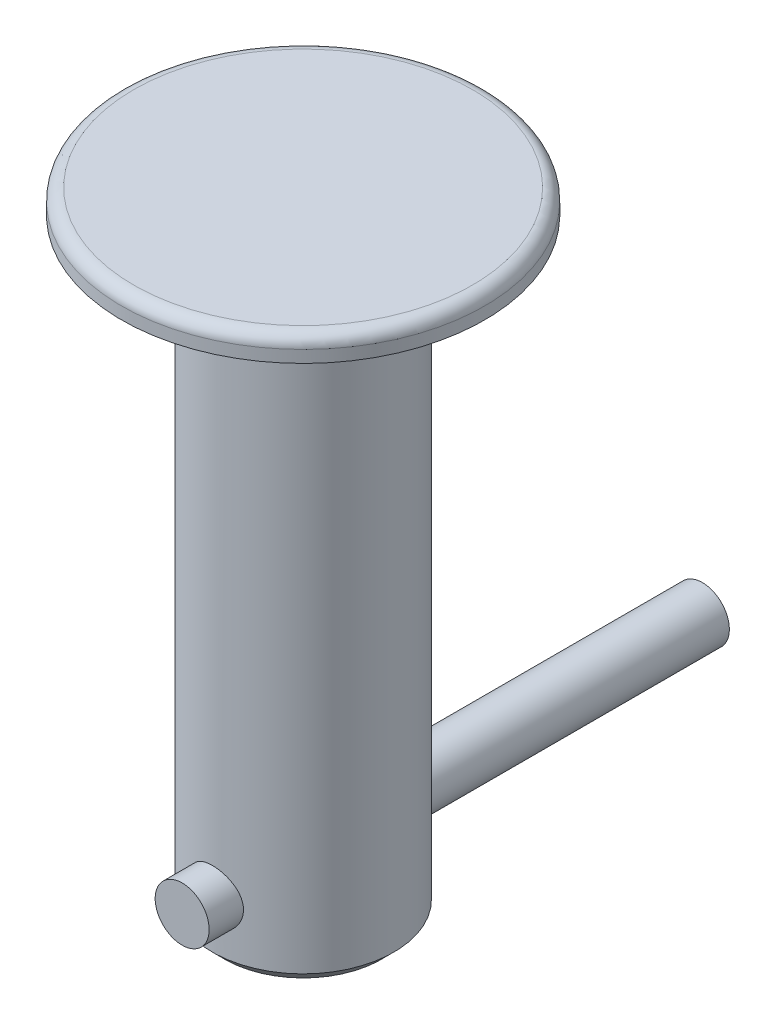
ISO-10303-21;
HEADER;
FILE_DESCRIPTION(('STEP AP214'),'2;1');
FILE_NAME('part.step','',(''),(''),'','','');
FILE_SCHEMA(('AUTOMOTIVE_DESIGN { 1 0 10303 214 1 1 1 1 }'));
ENDSEC;
DATA;
#1=APPLICATION_CONTEXT('core data for automotive mechanical design processes');
#2=APPLICATION_PROTOCOL_DEFINITION('international standard','automotive_design',2000,#1);
#3=PRODUCT_CONTEXT('',#1,'mechanical');
#4=PRODUCT('Part','Part','',(#3));
#5=PRODUCT_RELATED_PRODUCT_CATEGORY('part','',(#4));
#6=PRODUCT_DEFINITION_FORMATION('','',#4);
#7=PRODUCT_DEFINITION_CONTEXT('part definition',#1,'design');
#8=PRODUCT_DEFINITION('design','',#6,#7);
#9=PRODUCT_DEFINITION_SHAPE('','',#8);
#10=(LENGTH_UNIT() NAMED_UNIT(*) SI_UNIT(.MILLI.,.METRE.));
#11=(NAMED_UNIT(*) PLANE_ANGLE_UNIT() SI_UNIT($,.RADIAN.));
#12=(NAMED_UNIT(*) SI_UNIT($,.STERADIAN.) SOLID_ANGLE_UNIT());
#13=UNCERTAINTY_MEASURE_WITH_UNIT(LENGTH_MEASURE(1.E-05),#10,'distance_accuracy_value','');
#14=(GEOMETRIC_REPRESENTATION_CONTEXT(3) GLOBAL_UNCERTAINTY_ASSIGNED_CONTEXT((#13)) GLOBAL_UNIT_ASSIGNED_CONTEXT((#10,
#11,#12)) REPRESENTATION_CONTEXT('',''));
#15=CARTESIAN_POINT('',(0.,0.,0.));
#16=DIRECTION('',(0.,0.,1.));
#17=DIRECTION('',(1.,0.,0.));
#18=AXIS2_PLACEMENT_3D('',#15,#16,#17);
#19=CARTESIAN_POINT('',(0.,2.,0.));
#20=DIRECTION('',(0.,1.,0.));
#21=DIRECTION('',(-1.,0.,0.));
#22=AXIS2_PLACEMENT_3D('',#19,#20,#21);
#23=PLANE('',#22);
#24=CARTESIAN_POINT('',(0.,2.,0.));
#25=DIRECTION('',(0.,1.,0.));
#26=DIRECTION('',(-1.,0.,0.));
#27=AXIS2_PLACEMENT_3D('',#24,#25,#26);
#28=CIRCLE('',#27,14.);
#29=CARTESIAN_POINT('',(-14.,2.,0.));
#30=VERTEX_POINT('',#29);
#31=EDGE_CURVE('E54',#30,#30,#28,.T.);
#32=ORIENTED_EDGE('',*,*,#31,.T.);
#33=EDGE_LOOP('',(#32));
#34=FACE_BOUND('',#33,.T.);
#35=ADVANCED_FACE('F35',(#34),#23,.T.);
#36=CARTESIAN_POINT('',(0.,0.,0.));
#37=DIRECTION('',(0.,1.,0.));
#38=DIRECTION('',(-1.,0.,0.));
#39=AXIS2_PLACEMENT_3D('',#36,#37,#38);
#40=CYLINDRICAL_SURFACE('',#39,15.);
#41=CARTESIAN_POINT('',(0.,1.,0.));
#42=DIRECTION('',(0.,1.,0.));
#43=DIRECTION('',(-1.,0.,0.));
#44=AXIS2_PLACEMENT_3D('',#41,#42,#43);
#45=CIRCLE('',#44,15.);
#46=CARTESIAN_POINT('',(-15.,0.999999999999999,0.));
#47=VERTEX_POINT('',#46);
#48=EDGE_CURVE('E50',#47,#47,#45,.F.);
#49=ORIENTED_EDGE('',*,*,#48,.T.);
#50=EDGE_LOOP('',(#49));
#51=FACE_BOUND('',#50,.T.);
#52=CARTESIAN_POINT('',(0.,0.,0.));
#53=DIRECTION('',(0.,1.,0.));
#54=DIRECTION('',(-1.,0.,0.));
#55=AXIS2_PLACEMENT_3D('',#52,#53,#54);
#56=CIRCLE('',#55,15.);
#57=CARTESIAN_POINT('',(-15.,0.,0.));
#58=VERTEX_POINT('',#57);
#59=EDGE_CURVE('E101',#58,#58,#56,.T.);
#60=ORIENTED_EDGE('',*,*,#59,.T.);
#61=EDGE_LOOP('',(#60));
#62=FACE_BOUND('',#61,.T.);
#63=ADVANCED_FACE('F85',(#51,#62),#40,.T.);
#64=CARTESIAN_POINT('',(0.,0.,0.));
#65=DIRECTION('',(0.,1.,0.));
#66=DIRECTION('',(-1.,0.,0.));
#67=AXIS2_PLACEMENT_3D('',#64,#65,#66);
#68=PLANE('',#67);
#69=ORIENTED_EDGE('',*,*,#59,.F.);
#70=EDGE_LOOP('',(#69));
#71=FACE_BOUND('',#70,.T.);
#72=CARTESIAN_POINT('',(0.,0.,0.));
#73=DIRECTION('',(0.,1.,0.));
#74=DIRECTION('',(-1.,0.,0.));
#75=AXIS2_PLACEMENT_3D('',#72,#73,#74);
#76=CIRCLE('',#75,7.5);
#77=CARTESIAN_POINT('',(-7.5,0.,0.));
#78=VERTEX_POINT('',#77);
#79=EDGE_CURVE('E104',#78,#78,#76,.T.);
#80=ORIENTED_EDGE('',*,*,#79,.T.);
#81=EDGE_LOOP('',(#80));
#82=FACE_BOUND('',#81,.T.);
#83=ADVANCED_FACE('F81',(#71,#82),#68,.F.);
#84=CARTESIAN_POINT('',(0.,0.,0.));
#85=DIRECTION('',(0.,1.,0.));
#86=DIRECTION('',(-1.,0.,0.));
#87=AXIS2_PLACEMENT_3D('',#84,#85,#86);
#88=CYLINDRICAL_SURFACE('',#87,7.5);
#89=CARTESIAN_POINT('',(2.23039128314299,-45.0197459356697,-7.16068116341453));
#90=CARTESIAN_POINT('',(2.23038962713588,-45.1420172086892,-7.16068252015822));
#91=CARTESIAN_POINT('',(2.22030261492113,-45.2643048993603,-7.16384717289941));
#92=CARTESIAN_POINT('',(2.18032272965578,-45.5053086655589,-7.17611435312003));
#93=CARTESIAN_POINT('',(2.15042297462845,-45.6240234850615,-7.18521894382611));
#94=CARTESIAN_POINT('',(2.07191973773352,-45.8543579413405,-7.20824561723514));
#95=CARTESIAN_POINT('',(2.0233469615472,-45.9659888774978,-7.22215978735746));
#96=CARTESIAN_POINT('',(1.90897703327328,-46.1795440916206,-7.25322718496514));
#97=CARTESIAN_POINT('',(1.84317740023542,-46.2814669685802,-7.27038087889588));
#98=CARTESIAN_POINT('',(1.69403099333355,-46.4758824045404,-7.30659276129618));
#99=CARTESIAN_POINT('',(1.61024214744951,-46.5680284479204,-7.32569098601709));
#100=CARTESIAN_POINT('',(1.42844342237811,-46.7371901590806,-7.36329774723439));
#101=CARTESIAN_POINT('',(1.33043174904954,-46.8142039151063,-7.38180620897525));
#102=CARTESIAN_POINT('',(1.12050962660798,-46.9524146784126,-7.41660215811796));
#103=CARTESIAN_POINT('',(1.00835754273942,-47.0132590996787,-7.43283696876858));
#104=CARTESIAN_POINT('',(0.774848744709643,-47.1150903681032,-7.46079171432808));
#105=CARTESIAN_POINT('',(0.653493985816778,-47.1560814198594,-7.47251260509877));
#106=CARTESIAN_POINT('',(0.40864921257445,-47.2158977135471,-7.48983561667407));
#107=CARTESIAN_POINT('',(0.285315390110754,-47.235314264064,-7.49560064437347));
#108=CARTESIAN_POINT('',(0.0370149659236924,-47.2532993462391,-7.50093572729731));
#109=CARTESIAN_POINT('',(-0.0879512932820197,-47.251872183293,-7.50050706186693));
#110=CARTESIAN_POINT('',(-0.331823624311856,-47.2286088642215,-7.49361855744024));
#111=CARTESIAN_POINT('',(-0.450796950869426,-47.2074129186571,-7.48734791735631));
#112=CARTESIAN_POINT('',(-0.683414465096458,-47.146258546536,-7.46970942914605));
#113=CARTESIAN_POINT('',(-0.797058317071128,-47.1062989398286,-7.45834126040988));
#114=CARTESIAN_POINT('',(-1.01732198250068,-47.0083134466728,-7.43152193635796));
#115=CARTESIAN_POINT('',(-1.12384580398572,-46.9500847516064,-7.41602525635621));
#116=CARTESIAN_POINT('',(-1.32581624183355,-46.8173739876691,-7.38259481006543));
#117=CARTESIAN_POINT('',(-1.4212602587352,-46.7428881164187,-7.36466047400559));
#118=CARTESIAN_POINT('',(-1.6021827619474,-46.5764504149946,-7.32747364129597));
#119=CARTESIAN_POINT('',(-1.68714634216678,-46.4839435376971,-7.30819694769795));
#120=CARTESIAN_POINT('',(-1.84049826844691,-46.2858055752003,-7.27109396461215));
#121=CARTESIAN_POINT('',(-1.90888502620071,-46.1801732338511,-7.25326781421668));
#122=CARTESIAN_POINT('',(-2.02766666108713,-45.9574471281368,-7.22097003978414));
#123=CARTESIAN_POINT('',(-2.07788870754404,-45.8402561101646,-7.20653107644645));
#124=CARTESIAN_POINT('',(-2.15773367877396,-45.5985513481028,-7.1830312186394));
#125=CARTESIAN_POINT('',(-2.18736318648433,-45.474039957977,-7.17396860561644));
#126=CARTESIAN_POINT('',(-2.22422577768206,-45.2261225373443,-7.16262384643026));
#127=CARTESIAN_POINT('',(-2.23224037450195,-45.1028434337109,-7.16010522307408));
#128=CARTESIAN_POINT('',(-2.22782567897405,-44.8566990567673,-7.16148026171891));
#129=CARTESIAN_POINT('',(-2.21539918922544,-44.7338337290403,-7.16537304467662));
#130=CARTESIAN_POINT('',(-2.17115052048643,-44.495243378125,-7.17890047397109));
#131=CARTESIAN_POINT('',(-2.13982887390321,-44.3794162650682,-7.18838680560012));
#132=CARTESIAN_POINT('',(-2.0592579146541,-44.1546682701726,-7.21187951682311));
#133=CARTESIAN_POINT('',(-2.01000586686802,-44.045748444956,-7.22588658597759));
#134=CARTESIAN_POINT('',(-1.89348138098505,-43.8347208728094,-7.25730329266191));
#135=CARTESIAN_POINT('',(-1.8257666802352,-43.7328695713429,-7.27479314258952));
#136=CARTESIAN_POINT('',(-1.67476612757772,-43.5416899015162,-7.31103114188238));
#137=CARTESIAN_POINT('',(-1.59147661411199,-43.4523644865862,-7.32977958647099));
#138=CARTESIAN_POINT('',(-1.40802131015667,-43.2853682728577,-7.36726169797105));
#139=CARTESIAN_POINT('',(-1.30734519236205,-43.2082508592847,-7.38596916085803));
#140=CARTESIAN_POINT('',(-1.09403680993874,-43.071993004387,-7.4205619819491));
#141=CARTESIAN_POINT('',(-0.981405146785843,-43.0128516592758,-7.43644748201694));
#142=CARTESIAN_POINT('',(-0.74813541876216,-42.914794938556,-7.46350857381306));
#143=CARTESIAN_POINT('',(-0.627565408159063,-42.8757278709379,-7.47471936480696));
#144=CARTESIAN_POINT('',(-0.38117914440466,-42.8185349457795,-7.49132334668309));
#145=CARTESIAN_POINT('',(-0.255364374097608,-42.8004032102697,-7.49671817047407));
#146=CARTESIAN_POINT('',(-0.0071784204063822,-42.7860363340732,-7.50098477035609));
#147=CARTESIAN_POINT('',(0.115142737443675,-42.7889979775668,-7.5000958359071));
#148=CARTESIAN_POINT('',(0.357469376434651,-42.8148181962398,-7.49245690838212));
#149=CARTESIAN_POINT('',(0.477474984604598,-42.8376756767607,-7.48570723776081));
#150=CARTESIAN_POINT('',(0.710552193768124,-42.9021448114082,-7.46717183623904));
#151=CARTESIAN_POINT('',(0.82368289261493,-42.9435591058825,-7.45543916841102));
#152=CARTESIAN_POINT('',(1.04144979926863,-43.0437899807811,-7.42815179777043));
#153=CARTESIAN_POINT('',(1.14608462156045,-43.1026093924121,-7.41259647321449));
#154=CARTESIAN_POINT('',(1.34748125638725,-43.2381361266656,-7.37868947119974));
#155=CARTESIAN_POINT('',(1.44388997065791,-43.3153498033153,-7.36026498357221));
#156=CARTESIAN_POINT('',(1.62265086631906,-43.4845574647224,-7.3229338268028));
#157=CARTESIAN_POINT('',(1.70499901666604,-43.5765556734537,-7.30402702116413));
#158=CARTESIAN_POINT('',(1.85570842720902,-43.7759385602619,-7.2672244082684));
#159=CARTESIAN_POINT('',(1.92359226084419,-43.8836934399118,-7.24937410741844));
#160=CARTESIAN_POINT('',(2.04020017249895,-44.1095993539522,-7.21742752832217));
#161=CARTESIAN_POINT('',(2.08893374586996,-44.2277452004922,-7.20332939074742));
#162=CARTESIAN_POINT('',(2.16129924938426,-44.4573815555663,-7.18192485509835));
#163=CARTESIAN_POINT('',(2.18713828975532,-44.5681255631295,-7.17403282621482));
#164=CARTESIAN_POINT('',(2.22168343190508,-44.7924906699114,-7.16341084531984));
#165=CARTESIAN_POINT('',(2.23039282217915,-44.9061112126591,-7.16067990250354));
#166=CARTESIAN_POINT('',(2.23039128314299,-45.0197459356697,-7.16068116341453));
#167=B_SPLINE_CURVE_WITH_KNOTS('',3,(#89,#90,#91,#92,#93,#94,#95,#96,#97,#98,#99,#100,#101,#102,
#103,#104,#105,#106,#107,#108,#109,#110,#111,#112,#113,#114,#115,#116,#117,#118,#119,#120,#121,
#122,#123,#124,#125,#126,#127,#128,#129,#130,#131,#132,#133,#134,#135,#136,#137,#138,#139,#140,
#141,#142,#143,#144,#145,#146,#147,#148,#149,#150,#151,#152,#153,#154,#155,#156,#157,#158,#159,
#160,#161,#162,#163,#164,#165,#166),.UNSPECIFIED.,.T.,.F.,(4,2,2,2,2,2,2,2,2,2,2,2,2,2,2,2,2,2,
2,2,2,2,2,2,2,2,2,2,2,2,2,2,2,2,2,2,2,2,4),(0.,0.366394750832368,0.73291683602049,
1.09883877725747,1.46481344627914,1.84109720628874,2.21742847401154,2.60139468547264,
2.98527954398119,3.35836146009992,3.73136631497042,4.09269591958792,4.45404825327417,
4.81956311569569,5.18516355991581,5.56462272103515,5.94411822564616,6.32713498878459,
6.71002925432467,7.0788812928067,7.44768276361187,7.8071191663269,8.16661042079672,
8.53561208896756,8.90470061683975,9.28744295351398,9.67016604378587,10.0499528942697,
10.4296330868435,10.7949348799777,11.1602165756692,11.5217023054471,11.8832468687269,
12.2562119222395,12.6292837227617,13.0132253164461,13.3969762978707,13.7375563891414,
14.0780710905524),.UNSPECIFIED.);
#168=CARTESIAN_POINT('',(2.23039128314299,-45.0197459356697,-7.16068116341453));
#169=VERTEX_POINT('',#168);
#170=EDGE_CURVE('E10',#169,#169,#167,.T.);
#171=ORIENTED_EDGE('',*,*,#170,.F.);
#172=EDGE_LOOP('',(#171));
#173=FACE_BOUND('',#172,.T.);
#174=CARTESIAN_POINT('',(2.23039128314299,-45.0197459356697,7.16068116341453));
#175=CARTESIAN_POINT('',(2.23038962713588,-44.8974746626502,7.16068252015822));
#176=CARTESIAN_POINT('',(2.22030261492113,-44.7751869719791,7.16384717289941));
#177=CARTESIAN_POINT('',(2.18032272965578,-44.5341832057805,7.17611435312003));
#178=CARTESIAN_POINT('',(2.15042297462845,-44.4154683862779,7.18521894382611));
#179=CARTESIAN_POINT('',(2.07191973773352,-44.1851339299989,7.20824561723514));
#180=CARTESIAN_POINT('',(2.0233469615472,-44.0735029938416,7.22215978735746));
#181=CARTESIAN_POINT('',(1.90897703327328,-43.8599477797189,7.25322718496514));
#182=CARTESIAN_POINT('',(1.84317740023542,-43.7580249027592,7.27038087889588));
#183=CARTESIAN_POINT('',(1.69403099333355,-43.563609466799,7.30659276129618));
#184=CARTESIAN_POINT('',(1.61024214744951,-43.471463423419,7.32569098601709));
#185=CARTESIAN_POINT('',(1.42844342237811,-43.3023017122588,7.36329774723439));
#186=CARTESIAN_POINT('',(1.33043174904954,-43.2252879562331,7.38180620897525));
#187=CARTESIAN_POINT('',(1.12050962660798,-43.0870771929268,7.41660215811796));
#188=CARTESIAN_POINT('',(1.00835754273942,-43.0262327716607,7.43283696876858));
#189=CARTESIAN_POINT('',(0.774848744709643,-42.9244015032363,7.46079171432808));
#190=CARTESIAN_POINT('',(0.653493985816778,-42.88341045148,7.47251260509877));
#191=CARTESIAN_POINT('',(0.40864921257445,-42.8235941577923,7.48983561667407));
#192=CARTESIAN_POINT('',(0.285315390110754,-42.8041776072754,7.49560064437347));
#193=CARTESIAN_POINT('',(0.0370149659236924,-42.7861925251003,7.50093572729731));
#194=CARTESIAN_POINT('',(-0.0879512932820198,-42.7876196880464,7.50050706186693));
#195=CARTESIAN_POINT('',(-0.331823624311856,-42.8108830071179,7.49361855744024));
#196=CARTESIAN_POINT('',(-0.450796950869426,-42.8320789526823,7.48734791735631));
#197=CARTESIAN_POINT('',(-0.683414465096458,-42.8932333248034,7.46970942914605));
#198=CARTESIAN_POINT('',(-0.797058317071128,-42.9331929315108,7.45834126040988));
#199=CARTESIAN_POINT('',(-1.01732198250068,-43.0311784246666,7.43152193635796));
#200=CARTESIAN_POINT('',(-1.12384580398572,-43.089407119733,7.41602525635621));
#201=CARTESIAN_POINT('',(-1.32581624183355,-43.2221178836703,7.38259481006543));
#202=CARTESIAN_POINT('',(-1.4212602587352,-43.2966037549207,7.36466047400559));
#203=CARTESIAN_POINT('',(-1.6021827619474,-43.4630414563448,7.32747364129597));
#204=CARTESIAN_POINT('',(-1.68714634216678,-43.5555483336423,7.30819694769795));
#205=CARTESIAN_POINT('',(-1.84049826844691,-43.7536862961392,7.27109396461215));
#206=CARTESIAN_POINT('',(-1.90888502620071,-43.8593186374883,7.25326781421668));
#207=CARTESIAN_POINT('',(-2.02766666108713,-44.0820447432026,7.22097003978414));
#208=CARTESIAN_POINT('',(-2.07788870754404,-44.1992357611748,7.20653107644645));
#209=CARTESIAN_POINT('',(-2.15773367877396,-44.4409405232366,7.1830312186394));
#210=CARTESIAN_POINT('',(-2.18736318648433,-44.5654519133624,7.17396860561644));
#211=CARTESIAN_POINT('',(-2.22422577768206,-44.8133693339951,7.16262384643026));
#212=CARTESIAN_POINT('',(-2.23224037450195,-44.9366484376285,7.16010522307408));
#213=CARTESIAN_POINT('',(-2.22782567897405,-45.1827928145721,7.16148026171891));
#214=CARTESIAN_POINT('',(-2.21539918922544,-45.3056581422991,7.16537304467662));
#215=CARTESIAN_POINT('',(-2.17115052048643,-45.5442484932144,7.17890047397109));
#216=CARTESIAN_POINT('',(-2.13982887390321,-45.6600756062712,7.18838680560012));
#217=CARTESIAN_POINT('',(-2.0592579146541,-45.8848236011668,7.21187951682311));
#218=CARTESIAN_POINT('',(-2.01000586686802,-45.9937434263834,7.22588658597759));
#219=CARTESIAN_POINT('',(-1.89348138098505,-46.20477099853,7.25730329266191));
#220=CARTESIAN_POINT('',(-1.82576668023521,-46.3066222999965,7.27479314258952));
#221=CARTESIAN_POINT('',(-1.67476612757773,-46.4978019698232,7.31103114188237));
#222=CARTESIAN_POINT('',(-1.591476614112,-46.5871273847532,7.32977958647099));
#223=CARTESIAN_POINT('',(-1.40802131015667,-46.7541235984817,7.36726169797105));
#224=CARTESIAN_POINT('',(-1.30734519236205,-46.8312410120547,7.38596916085803));
#225=CARTESIAN_POINT('',(-1.09403680993874,-46.9674988669524,7.4205619819491));
#226=CARTESIAN_POINT('',(-0.981405146785843,-47.0266402120636,7.43644748201694));
#227=CARTESIAN_POINT('',(-0.74813541876216,-47.1246969327834,7.46350857381306));
#228=CARTESIAN_POINT('',(-0.627565408159064,-47.1637640004015,7.47471936480696));
#229=CARTESIAN_POINT('',(-0.381179144404661,-47.2209569255599,7.49132334668309));
#230=CARTESIAN_POINT('',(-0.255364374097609,-47.2390886610697,7.49671817047407));
#231=CARTESIAN_POINT('',(-0.00717842040638201,-47.2534555372662,7.50098477035609));
#232=CARTESIAN_POINT('',(0.115142737443675,-47.2504938937726,7.5000958359071));
#233=CARTESIAN_POINT('',(0.357469376434651,-47.2246736750996,7.49245690838212));
#234=CARTESIAN_POINT('',(0.477474984604598,-47.2018161945787,7.48570723776081));
#235=CARTESIAN_POINT('',(0.710552193768124,-47.1373470599312,7.46717183623904));
#236=CARTESIAN_POINT('',(0.82368289261493,-47.0959327654569,7.45543916841102));
#237=CARTESIAN_POINT('',(1.04144979926863,-46.9957018905583,7.42815179777043));
#238=CARTESIAN_POINT('',(1.14608462156045,-46.9368824789273,7.41259647321449));
#239=CARTESIAN_POINT('',(1.34748125638725,-46.8013557446738,7.37868947119974));
#240=CARTESIAN_POINT('',(1.44388997065791,-46.7241420680241,7.36026498357221));
#241=CARTESIAN_POINT('',(1.62265086631906,-46.554934406617,7.3229338268028));
#242=CARTESIAN_POINT('',(1.70499901666604,-46.4629361978857,7.30402702116413));
#243=CARTESIAN_POINT('',(1.85570842720902,-46.2635533110775,7.2672244082684));
#244=CARTESIAN_POINT('',(1.92359226084419,-46.1557984314276,7.24937410741844));
#245=CARTESIAN_POINT('',(2.04020017249895,-45.9298925173872,7.21742752832217));
#246=CARTESIAN_POINT('',(2.08893374586996,-45.8117466708472,7.20332939074742));
#247=CARTESIAN_POINT('',(2.16129924938426,-45.5821103157731,7.18192485509835));
#248=CARTESIAN_POINT('',(2.18713828975532,-45.4713663082099,7.17403282621482));
#249=CARTESIAN_POINT('',(2.22168343190508,-45.247001201428,7.16341084531984));
#250=CARTESIAN_POINT('',(2.23039282217915,-45.1333806586803,7.16067990250354));
#251=CARTESIAN_POINT('',(2.23039128314299,-45.0197459356697,7.16068116341453));
#252=B_SPLINE_CURVE_WITH_KNOTS('',3,(#174,#175,#176,#177,#178,#179,#180,#181,#182,#183,#184,
#185,#186,#187,#188,#189,#190,#191,#192,#193,#194,#195,#196,#197,#198,#199,#200,#201,#202,#203,
#204,#205,#206,#207,#208,#209,#210,#211,#212,#213,#214,#215,#216,#217,#218,#219,#220,#221,#222,
#223,#224,#225,#226,#227,#228,#229,#230,#231,#232,#233,#234,#235,#236,#237,#238,#239,#240,#241,
#242,#243,#244,#245,#246,#247,#248,#249,#250,#251),.UNSPECIFIED.,.T.,.F.,(4,2,2,2,2,2,2,2,2,2,2,
2,2,2,2,2,2,2,2,2,2,2,2,2,2,2,2,2,2,2,2,2,2,2,2,2,2,2,4),(0.,0.366394750832368,0.73291683602049,
1.09883877725747,1.46481344627914,1.84109720628874,2.21742847401154,2.60139468547264,
2.98527954398119,3.35836146009992,3.73136631497042,4.09269591958792,4.45404825327417,
4.81956311569569,5.18516355991581,5.56462272103515,5.94411822564616,6.32713498878459,
6.71002925432467,7.07888129280671,7.44768276361187,7.8071191663269,8.16661042079672,
8.53561208896755,8.90470061683975,9.28744295351398,9.67016604378587,10.0499528942697,
10.4296330868435,10.7949348799777,11.1602165756692,11.5217023054471,11.8832468687269,
12.2562119222395,12.6292837227617,13.0132253164461,13.3969762978707,13.7375563891414,
14.0780710905524),.UNSPECIFIED.);
#253=CARTESIAN_POINT('',(2.23039128314299,-45.0197459356697,7.16068116341453));
#254=VERTEX_POINT('',#253);
#255=EDGE_CURVE('E46',#254,#254,#252,.T.);
#256=ORIENTED_EDGE('',*,*,#255,.F.);
#257=EDGE_LOOP('',(#256));
#258=FACE_BOUND('',#257,.T.);
#259=CARTESIAN_POINT('',(0.,-49.,0.));
#260=DIRECTION('',(0.,1.,0.));
#261=DIRECTION('',(-1.,0.,0.));
#262=AXIS2_PLACEMENT_3D('',#259,#260,#261);
#263=CIRCLE('',#262,7.5);
#264=CARTESIAN_POINT('',(-7.49999999999999,-49.,0.));
#265=VERTEX_POINT('',#264);
#266=EDGE_CURVE('E108',#265,#265,#263,.T.);
#267=ORIENTED_EDGE('',*,*,#266,.T.);
#268=EDGE_LOOP('',(#267));
#269=FACE_BOUND('',#268,.T.);
#270=ORIENTED_EDGE('',*,*,#79,.F.);
#271=EDGE_LOOP('',(#270));
#272=FACE_BOUND('',#271,.T.);
#273=ADVANCED_FACE('F59',(#173,#258,#269,#272),#88,.T.);
#274=CARTESIAN_POINT('',(0.,-50.,0.));
#275=DIRECTION('',(0.,1.,0.));
#276=DIRECTION('',(-1.,0.,0.));
#277=AXIS2_PLACEMENT_3D('',#274,#275,#276);
#278=PLANE('',#277);
#279=CARTESIAN_POINT('',(0.,-50.,0.));
#280=DIRECTION('',(0.,1.,0.));
#281=DIRECTION('',(-1.,0.,0.));
#282=AXIS2_PLACEMENT_3D('',#279,#280,#281);
#283=CIRCLE('',#282,6.49999999999998);
#284=CARTESIAN_POINT('',(-6.49999999999997,-50.,0.));
#285=VERTEX_POINT('',#284);
#286=EDGE_CURVE('E117',#285,#285,#283,.F.);
#287=ORIENTED_EDGE('',*,*,#286,.T.);
#288=EDGE_LOOP('',(#287));
#289=FACE_BOUND('',#288,.T.);
#290=ADVANCED_FACE('F71',(#289),#278,.F.);
#291=CARTESIAN_POINT('',(0.,-49.,0.));
#292=DIRECTION('',(0.,1.,0.));
#293=DIRECTION('',(-1.,0.,0.));
#294=AXIS2_PLACEMENT_3D('',#291,#292,#293);
#295=CONICAL_SURFACE('',#294,7.5,0.785398163397452);
#296=ORIENTED_EDGE('',*,*,#286,.F.);
#297=EDGE_LOOP('',(#296));
#298=FACE_BOUND('',#297,.T.);
#299=ORIENTED_EDGE('',*,*,#266,.F.);
#300=EDGE_LOOP('',(#299));
#301=FACE_BOUND('',#300,.T.);
#302=ADVANCED_FACE('F74',(#298,#301),#295,.T.);
#303=CARTESIAN_POINT('',(0.,1.,0.));
#304=DIRECTION('',(0.,1.,0.));
#305=DIRECTION('',(-1.,0.,0.));
#306=AXIS2_PLACEMENT_3D('',#303,#304,#305);
#307=TOROIDAL_SURFACE('',#306,14.,1.);
#308=ORIENTED_EDGE('',*,*,#48,.F.);
#309=EDGE_LOOP('',(#308));
#310=FACE_BOUND('',#309,.T.);
#311=ORIENTED_EDGE('',*,*,#31,.F.);
#312=EDGE_LOOP('',(#311));
#313=FACE_BOUND('',#312,.T.);
#314=ADVANCED_FACE('F37',(#310,#313),#307,.T.);
#315=CARTESIAN_POINT('',(0.,-45.0197459356697,10.));
#316=DIRECTION('',(0.,0.,1.));
#317=DIRECTION('',(1.,0.,0.));
#318=AXIS2_PLACEMENT_3D('',#315,#316,#317);
#319=PLANE('',#318);
#320=CARTESIAN_POINT('',(0.,-45.0197459356697,10.));
#321=DIRECTION('',(0.,0.,1.));
#322=DIRECTION('',(1.,0.,0.));
#323=AXIS2_PLACEMENT_3D('',#320,#321,#322);
#324=CIRCLE('',#323,2.23039128314299);
#325=CARTESIAN_POINT('',(2.23039128314299,-45.0197459356697,10.));
#326=VERTEX_POINT('',#325);
#327=EDGE_CURVE('E111',#326,#326,#324,.T.);
#328=ORIENTED_EDGE('',*,*,#327,.T.);
#329=EDGE_LOOP('',(#328));
#330=FACE_BOUND('',#329,.T.);
#331=ADVANCED_FACE('F68',(#330),#319,.T.);
#332=CARTESIAN_POINT('',(0.,-45.0197459356697,-33.));
#333=DIRECTION('',(0.,0.,1.));
#334=DIRECTION('',(1.,0.,0.));
#335=AXIS2_PLACEMENT_3D('',#332,#333,#334);
#336=CYLINDRICAL_SURFACE('',#335,2.23039128314299);
#337=ORIENTED_EDGE('',*,*,#255,.T.);
#338=EDGE_LOOP('',(#337));
#339=FACE_BOUND('',#338,.T.);
#340=ORIENTED_EDGE('',*,*,#327,.F.);
#341=EDGE_LOOP('',(#340));
#342=FACE_BOUND('',#341,.T.);
#343=ADVANCED_FACE('F63',(#339,#342),#336,.T.);
#344=ORIENTED_EDGE('',*,*,#170,.T.);
#345=EDGE_LOOP('',(#344));
#346=FACE_BOUND('',#345,.T.);
#347=CARTESIAN_POINT('',(0.,-45.0197459356697,-33.));
#348=DIRECTION('',(0.,0.,1.));
#349=DIRECTION('',(1.,0.,0.));
#350=AXIS2_PLACEMENT_3D('',#347,#348,#349);
#351=CIRCLE('',#350,2.23039128314299);
#352=CARTESIAN_POINT('',(2.23039128314299,-45.0197459356697,-33.));
#353=VERTEX_POINT('',#352);
#354=EDGE_CURVE('E106',#353,#353,#351,.T.);
#355=ORIENTED_EDGE('',*,*,#354,.T.);
#356=EDGE_LOOP('',(#355));
#357=FACE_BOUND('',#356,.T.);
#358=ADVANCED_FACE('F67',(#346,#357),#336,.T.);
#359=CARTESIAN_POINT('',(0.,-45.0197459356697,-33.));
#360=DIRECTION('',(0.,0.,1.));
#361=DIRECTION('',(1.,0.,0.));
#362=AXIS2_PLACEMENT_3D('',#359,#360,#361);
#363=PLANE('',#362);
#364=ORIENTED_EDGE('',*,*,#354,.F.);
#365=EDGE_LOOP('',(#364));
#366=FACE_BOUND('',#365,.T.);
#367=ADVANCED_FACE('F69',(#366),#363,.F.);
#368=CLOSED_SHELL('',(#35,#63,#83,#273,#290,#302,#314,#331,#343,#358,#367));
#369=MANIFOLD_SOLID_BREP('B2',#368);
#370=ADVANCED_BREP_SHAPE_REPRESENTATION('',(#18,#369),#14);
#371=SHAPE_DEFINITION_REPRESENTATION(#9,#370);
ENDSEC;
END-ISO-10303-21;
